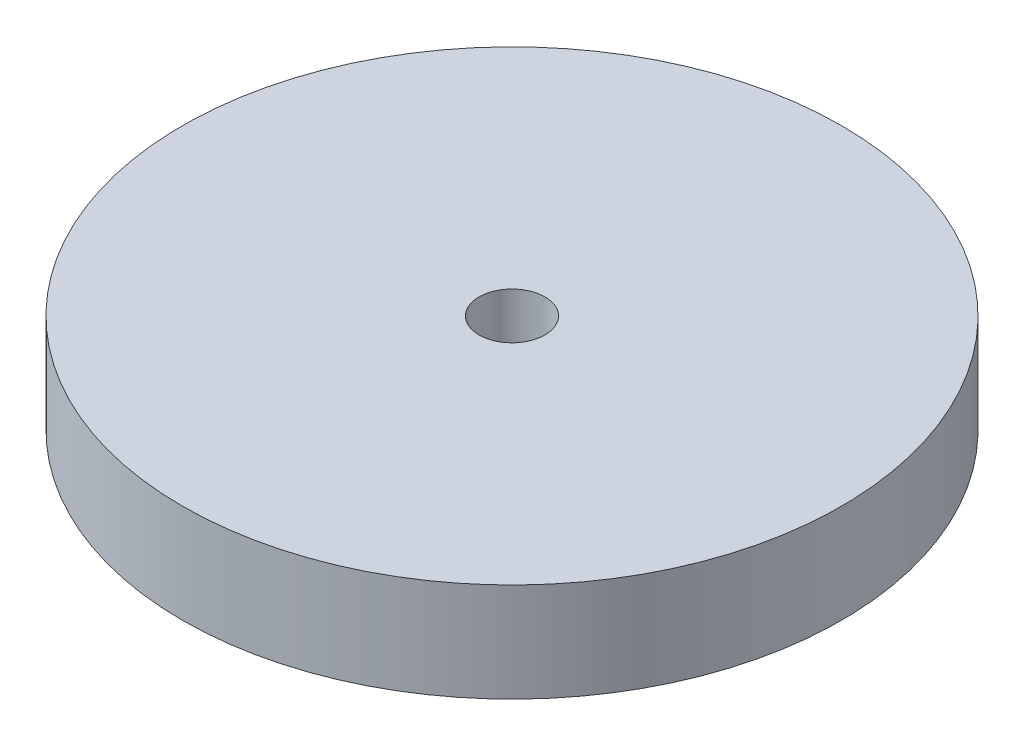
ISO-10303-21;
HEADER;
FILE_DESCRIPTION(('STEP AP214'),'2;1');
FILE_NAME('part.step','',(''),(''),'','','');
FILE_SCHEMA(('AUTOMOTIVE_DESIGN { 1 0 10303 214 1 1 1 1 }'));
ENDSEC;
DATA;
#1=APPLICATION_CONTEXT('core data for automotive mechanical design processes');
#2=APPLICATION_PROTOCOL_DEFINITION('international standard','automotive_design',2000,#1);
#3=PRODUCT_CONTEXT('',#1,'mechanical');
#4=PRODUCT('Part','Part','',(#3));
#5=PRODUCT_RELATED_PRODUCT_CATEGORY('part','',(#4));
#6=PRODUCT_DEFINITION_FORMATION('','',#4);
#7=PRODUCT_DEFINITION_CONTEXT('part definition',#1,'design');
#8=PRODUCT_DEFINITION('design','',#6,#7);
#9=PRODUCT_DEFINITION_SHAPE('','',#8);
#10=(LENGTH_UNIT() NAMED_UNIT(*) SI_UNIT(.MILLI.,.METRE.));
#11=(NAMED_UNIT(*) PLANE_ANGLE_UNIT() SI_UNIT($,.RADIAN.));
#12=(NAMED_UNIT(*) SI_UNIT($,.STERADIAN.) SOLID_ANGLE_UNIT());
#13=UNCERTAINTY_MEASURE_WITH_UNIT(LENGTH_MEASURE(1.E-05),#10,'distance_accuracy_value','');
#14=(GEOMETRIC_REPRESENTATION_CONTEXT(3) GLOBAL_UNCERTAINTY_ASSIGNED_CONTEXT((#13)) GLOBAL_UNIT_ASSIGNED_CONTEXT((#10,
#11,#12)) REPRESENTATION_CONTEXT('',''));
#15=CARTESIAN_POINT('',(0.,0.,0.));
#16=DIRECTION('',(0.,0.,1.));
#17=DIRECTION('',(1.,0.,0.));
#18=AXIS2_PLACEMENT_3D('',#15,#16,#17);
#19=CARTESIAN_POINT('',(0.,-7.5,0.));
#20=DIRECTION('',(0.,1.,0.));
#21=DIRECTION('',(0.,0.,1.));
#22=AXIS2_PLACEMENT_3D('',#19,#20,#21);
#23=CYLINDRICAL_SURFACE('',#22,50.);
#24=CARTESIAN_POINT('',(0.,-7.5,0.));
#25=DIRECTION('',(0.,1.,0.));
#26=DIRECTION('',(0.,0.,1.));
#27=AXIS2_PLACEMENT_3D('',#24,#25,#26);
#28=CIRCLE('',#27,50.);
#29=CARTESIAN_POINT('',(0.,-7.5,50.));
#30=VERTEX_POINT('',#29);
#31=EDGE_CURVE('E10',#30,#30,#28,.T.);
#32=ORIENTED_EDGE('',*,*,#31,.T.);
#33=EDGE_LOOP('',(#32));
#34=FACE_BOUND('',#33,.T.);
#35=CARTESIAN_POINT('',(0.,7.5,0.));
#36=DIRECTION('',(0.,1.,0.));
#37=DIRECTION('',(0.,0.,1.));
#38=AXIS2_PLACEMENT_3D('',#35,#36,#37);
#39=CIRCLE('',#38,50.);
#40=CARTESIAN_POINT('',(0.,7.5,50.));
#41=VERTEX_POINT('',#40);
#42=EDGE_CURVE('E39',#41,#41,#39,.T.);
#43=ORIENTED_EDGE('',*,*,#42,.F.);
#44=EDGE_LOOP('',(#43));
#45=FACE_BOUND('',#44,.T.);
#46=ADVANCED_FACE('F33',(#34,#45),#23,.T.);
#47=CARTESIAN_POINT('',(0.,-7.5,0.));
#48=DIRECTION('',(0.,1.,0.));
#49=DIRECTION('',(0.,0.,1.));
#50=AXIS2_PLACEMENT_3D('',#47,#48,#49);
#51=PLANE('',#50);
#52=CARTESIAN_POINT('',(0.,-7.5,0.));
#53=DIRECTION('',(0.,1.,0.));
#54=DIRECTION('',(0.,0.,1.));
#55=AXIS2_PLACEMENT_3D('',#52,#53,#54);
#56=CIRCLE('',#55,5.);
#57=CARTESIAN_POINT('',(0.,-7.5,5.));
#58=VERTEX_POINT('',#57);
#59=EDGE_CURVE('E43',#58,#58,#56,.T.);
#60=ORIENTED_EDGE('',*,*,#59,.T.);
#61=EDGE_LOOP('',(#60));
#62=FACE_BOUND('',#61,.T.);
#63=ORIENTED_EDGE('',*,*,#31,.F.);
#64=EDGE_LOOP('',(#63));
#65=FACE_BOUND('',#64,.T.);
#66=ADVANCED_FACE('F57',(#62,#65),#51,.F.);
#67=CARTESIAN_POINT('',(0.,7.5,0.));
#68=DIRECTION('',(0.,1.,0.));
#69=DIRECTION('',(0.,0.,1.));
#70=AXIS2_PLACEMENT_3D('',#67,#68,#69);
#71=PLANE('',#70);
#72=CARTESIAN_POINT('',(0.,7.5,0.));
#73=DIRECTION('',(0.,1.,0.));
#74=DIRECTION('',(0.,0.,1.));
#75=AXIS2_PLACEMENT_3D('',#72,#73,#74);
#76=CIRCLE('',#75,5.);
#77=CARTESIAN_POINT('',(0.,7.5,5.));
#78=VERTEX_POINT('',#77);
#79=EDGE_CURVE('E47',#78,#78,#76,.T.);
#80=ORIENTED_EDGE('',*,*,#79,.F.);
#81=EDGE_LOOP('',(#80));
#82=FACE_BOUND('',#81,.T.);
#83=ORIENTED_EDGE('',*,*,#42,.T.);
#84=EDGE_LOOP('',(#83));
#85=FACE_BOUND('',#84,.T.);
#86=ADVANCED_FACE('F55',(#82,#85),#71,.T.);
#87=CARTESIAN_POINT('',(0.,-7.5,0.));
#88=DIRECTION('',(0.,1.,0.));
#89=DIRECTION('',(0.,0.,1.));
#90=AXIS2_PLACEMENT_3D('',#87,#88,#89);
#91=CYLINDRICAL_SURFACE('',#90,5.);
#92=ORIENTED_EDGE('',*,*,#59,.F.);
#93=EDGE_LOOP('',(#92));
#94=FACE_BOUND('',#93,.T.);
#95=ORIENTED_EDGE('',*,*,#79,.T.);
#96=EDGE_LOOP('',(#95));
#97=FACE_BOUND('',#96,.T.);
#98=ADVANCED_FACE('F53',(#94,#97),#91,.F.);
#99=CLOSED_SHELL('',(#46,#66,#86,#98));
#100=MANIFOLD_SOLID_BREP('B2',#99);
#101=ADVANCED_BREP_SHAPE_REPRESENTATION('',(#18,#100),#14);
#102=SHAPE_DEFINITION_REPRESENTATION(#9,#101);
ENDSEC;
END-ISO-10303-21;
